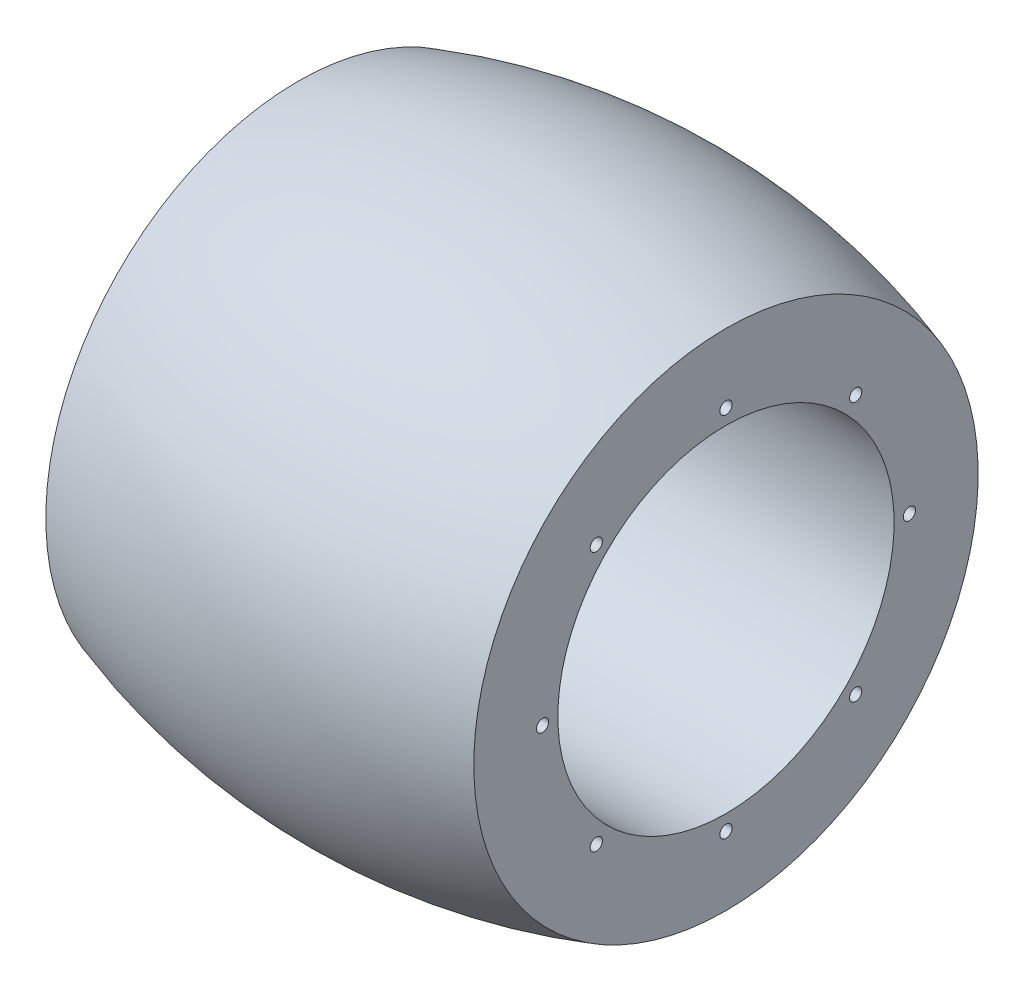
ISO-10303-21;
HEADER;
FILE_DESCRIPTION(('STEP AP214'),'2;1');
FILE_NAME('part.step','',(''),(''),'','','');
FILE_SCHEMA(('AUTOMOTIVE_DESIGN { 1 0 10303 214 1 1 1 1 }'));
ENDSEC;
DATA;
#1=APPLICATION_CONTEXT('core data for automotive mechanical design processes');
#2=APPLICATION_PROTOCOL_DEFINITION('international standard','automotive_design',2000,#1);
#3=PRODUCT_CONTEXT('',#1,'mechanical');
#4=PRODUCT('Part','Part','',(#3));
#5=PRODUCT_RELATED_PRODUCT_CATEGORY('part','',(#4));
#6=PRODUCT_DEFINITION_FORMATION('','',#4);
#7=PRODUCT_DEFINITION_CONTEXT('part definition',#1,'design');
#8=PRODUCT_DEFINITION('design','',#6,#7);
#9=PRODUCT_DEFINITION_SHAPE('','',#8);
#10=(LENGTH_UNIT() NAMED_UNIT(*) SI_UNIT(.MILLI.,.METRE.));
#11=(NAMED_UNIT(*) PLANE_ANGLE_UNIT() SI_UNIT($,.RADIAN.));
#12=(NAMED_UNIT(*) SI_UNIT($,.STERADIAN.) SOLID_ANGLE_UNIT());
#13=UNCERTAINTY_MEASURE_WITH_UNIT(LENGTH_MEASURE(1.E-05),#10,'distance_accuracy_value','');
#14=(GEOMETRIC_REPRESENTATION_CONTEXT(3) GLOBAL_UNCERTAINTY_ASSIGNED_CONTEXT((#13)) GLOBAL_UNIT_ASSIGNED_CONTEXT((#10,
#11,#12)) REPRESENTATION_CONTEXT('',''));
#15=CARTESIAN_POINT('',(0.,0.,0.));
#16=DIRECTION('',(0.,0.,1.));
#17=DIRECTION('',(1.,0.,0.));
#18=AXIS2_PLACEMENT_3D('',#15,#16,#17);
#19=CARTESIAN_POINT('',(-28.,0.,0.));
#20=DIRECTION('',(-1.,0.,0.));
#21=DIRECTION('',(0.,-1.,0.));
#22=AXIS2_PLACEMENT_3D('',#19,#20,#21);
#23=PLANE('',#22);
#24=CARTESIAN_POINT('',(-28.,0.,0.));
#25=DIRECTION('',(1.,0.,0.));
#26=DIRECTION('',(0.,1.,0.));
#27=AXIS2_PLACEMENT_3D('',#24,#25,#26);
#28=CIRCLE('',#27,22.);
#29=CARTESIAN_POINT('',(-28.,22.,0.));
#30=VERTEX_POINT('',#29);
#31=EDGE_CURVE('E11',#30,#30,#28,.T.);
#32=ORIENTED_EDGE('',*,*,#31,.T.);
#33=EDGE_LOOP('',(#32));
#34=FACE_BOUND('',#33,.T.);
#35=CARTESIAN_POINT('',(-28.,0.,0.));
#36=DIRECTION('',(1.,0.,0.));
#37=DIRECTION('',(0.,1.,0.));
#38=AXIS2_PLACEMENT_3D('',#35,#36,#37);
#39=CIRCLE('',#38,33.);
#40=CARTESIAN_POINT('',(-28.,33.,0.));
#41=VERTEX_POINT('',#40);
#42=EDGE_CURVE('E111',#41,#41,#39,.T.);
#43=ORIENTED_EDGE('',*,*,#42,.F.);
#44=EDGE_LOOP('',(#43));
#45=FACE_BOUND('',#44,.T.);
#46=ADVANCED_FACE('F37',(#34,#45),#23,.T.);
#47=CARTESIAN_POINT('',(0.,0.,0.));
#48=DIRECTION('',(1.,0.,0.));
#49=DIRECTION('',(0.,1.,0.));
#50=AXIS2_PLACEMENT_3D('',#47,#48,#49);
#51=CYLINDRICAL_SURFACE('',#50,22.);
#52=CARTESIAN_POINT('',(28.,0.,0.));
#53=DIRECTION('',(1.,0.,0.));
#54=DIRECTION('',(0.,1.,0.));
#55=AXIS2_PLACEMENT_3D('',#52,#53,#54);
#56=CIRCLE('',#55,22.);
#57=CARTESIAN_POINT('',(28.,22.,0.));
#58=VERTEX_POINT('',#57);
#59=EDGE_CURVE('E45',#58,#58,#56,.T.);
#60=ORIENTED_EDGE('',*,*,#59,.T.);
#61=EDGE_LOOP('',(#60));
#62=FACE_BOUND('',#61,.T.);
#63=ORIENTED_EDGE('',*,*,#31,.F.);
#64=EDGE_LOOP('',(#63));
#65=FACE_BOUND('',#64,.T.);
#66=ADVANCED_FACE('F154',(#62,#65),#51,.F.);
#67=CARTESIAN_POINT('',(28.,0.,0.));
#68=DIRECTION('',(-1.,0.,0.));
#69=DIRECTION('',(0.,-1.,0.));
#70=AXIS2_PLACEMENT_3D('',#67,#68,#69);
#71=PLANE('',#70);
#72=CARTESIAN_POINT('',(28.,24.,0.));
#73=DIRECTION('',(-1.,0.,0.));
#74=DIRECTION('',(0.,-1.,0.));
#75=AXIS2_PLACEMENT_3D('',#72,#73,#74);
#76=CIRCLE('',#75,0.799999999999999);
#77=CARTESIAN_POINT('',(28.,23.2,0.));
#78=VERTEX_POINT('',#77);
#79=EDGE_CURVE('E40',#78,#78,#76,.T.);
#80=ORIENTED_EDGE('',*,*,#79,.T.);
#81=EDGE_LOOP('',(#80));
#82=FACE_BOUND('',#81,.T.);
#83=CARTESIAN_POINT('',(28.,16.9705627484771,16.9705627484771));
#84=DIRECTION('',(-1.,0.,0.));
#85=DIRECTION('',(0.,-1.,0.));
#86=AXIS2_PLACEMENT_3D('',#83,#84,#85);
#87=CIRCLE('',#86,0.799999999999999);
#88=CARTESIAN_POINT('',(28.,16.1705627484771,16.9705627484771));
#89=VERTEX_POINT('',#88);
#90=EDGE_CURVE('E86',#89,#89,#87,.T.);
#91=ORIENTED_EDGE('',*,*,#90,.T.);
#92=EDGE_LOOP('',(#91));
#93=FACE_BOUND('',#92,.T.);
#94=CARTESIAN_POINT('',(28.,0.,24.));
#95=DIRECTION('',(-1.,0.,0.));
#96=DIRECTION('',(0.,-1.,0.));
#97=AXIS2_PLACEMENT_3D('',#94,#95,#96);
#98=CIRCLE('',#97,0.799999999999998);
#99=CARTESIAN_POINT('',(28.,-0.799999999999995,24.));
#100=VERTEX_POINT('',#99);
#101=EDGE_CURVE('E90',#100,#100,#98,.T.);
#102=ORIENTED_EDGE('',*,*,#101,.T.);
#103=EDGE_LOOP('',(#102));
#104=FACE_BOUND('',#103,.T.);
#105=CARTESIAN_POINT('',(28.,-16.9705627484771,16.9705627484771));
#106=DIRECTION('',(-1.,0.,0.));
#107=DIRECTION('',(0.,-1.,0.));
#108=AXIS2_PLACEMENT_3D('',#105,#106,#107);
#109=CIRCLE('',#108,0.799999999999999);
#110=CARTESIAN_POINT('',(28.,-17.7705627484771,16.9705627484771));
#111=VERTEX_POINT('',#110);
#112=EDGE_CURVE('E94',#111,#111,#109,.T.);
#113=ORIENTED_EDGE('',*,*,#112,.T.);
#114=EDGE_LOOP('',(#113));
#115=FACE_BOUND('',#114,.T.);
#116=CARTESIAN_POINT('',(28.,-24.,0.));
#117=DIRECTION('',(-1.,0.,0.));
#118=DIRECTION('',(0.,-1.,0.));
#119=AXIS2_PLACEMENT_3D('',#116,#117,#118);
#120=CIRCLE('',#119,0.799999999999999);
#121=CARTESIAN_POINT('',(28.,-24.8,0.));
#122=VERTEX_POINT('',#121);
#123=EDGE_CURVE('E98',#122,#122,#120,.T.);
#124=ORIENTED_EDGE('',*,*,#123,.T.);
#125=EDGE_LOOP('',(#124));
#126=FACE_BOUND('',#125,.T.);
#127=CARTESIAN_POINT('',(28.,-16.9705627484771,-16.9705627484771));
#128=DIRECTION('',(-1.,0.,0.));
#129=DIRECTION('',(0.,-1.,0.));
#130=AXIS2_PLACEMENT_3D('',#127,#128,#129);
#131=CIRCLE('',#130,0.799999999999999);
#132=CARTESIAN_POINT('',(28.,-17.7705627484771,-16.9705627484771));
#133=VERTEX_POINT('',#132);
#134=EDGE_CURVE('E102',#133,#133,#131,.T.);
#135=ORIENTED_EDGE('',*,*,#134,.T.);
#136=EDGE_LOOP('',(#135));
#137=FACE_BOUND('',#136,.T.);
#138=CARTESIAN_POINT('',(28.,0.,-24.));
#139=DIRECTION('',(-1.,0.,0.));
#140=DIRECTION('',(0.,-1.,0.));
#141=AXIS2_PLACEMENT_3D('',#138,#139,#140);
#142=CIRCLE('',#141,0.799999999999998);
#143=CARTESIAN_POINT('',(28.,-0.800000000000001,-24.));
#144=VERTEX_POINT('',#143);
#145=EDGE_CURVE('E106',#144,#144,#142,.T.);
#146=ORIENTED_EDGE('',*,*,#145,.T.);
#147=EDGE_LOOP('',(#146));
#148=FACE_BOUND('',#147,.T.);
#149=CARTESIAN_POINT('',(28.,16.9705627484771,-16.9705627484771));
#150=DIRECTION('',(-1.,0.,0.));
#151=DIRECTION('',(0.,-1.,0.));
#152=AXIS2_PLACEMENT_3D('',#149,#150,#151);
#153=CIRCLE('',#152,0.799999999999999);
#154=CARTESIAN_POINT('',(28.,16.1705627484771,-16.9705627484771));
#155=VERTEX_POINT('',#154);
#156=EDGE_CURVE('E110',#155,#155,#153,.T.);
#157=ORIENTED_EDGE('',*,*,#156,.T.);
#158=EDGE_LOOP('',(#157));
#159=FACE_BOUND('',#158,.T.);
#160=ORIENTED_EDGE('',*,*,#59,.F.);
#161=EDGE_LOOP('',(#160));
#162=FACE_BOUND('',#161,.T.);
#163=CARTESIAN_POINT('',(28.,0.,0.));
#164=DIRECTION('',(1.,0.,0.));
#165=DIRECTION('',(0.,1.,0.));
#166=AXIS2_PLACEMENT_3D('',#163,#164,#165);
#167=CIRCLE('',#166,33.);
#168=CARTESIAN_POINT('',(28.,33.,0.));
#169=VERTEX_POINT('',#168);
#170=EDGE_CURVE('E114',#169,#169,#167,.T.);
#171=ORIENTED_EDGE('',*,*,#170,.T.);
#172=EDGE_LOOP('',(#171));
#173=FACE_BOUND('',#172,.T.);
#174=ADVANCED_FACE('F134',(#82,#93,#104,#115,#126,#137,#148,#159,#162,#173),#71,.F.);
#175=CARTESIAN_POINT('',(0.,0.,0.));
#176=DIRECTION('',(1.,0.,0.));
#177=DIRECTION('',(0.,1.,0.));
#178=AXIS2_PLACEMENT_3D('',#175,#176,#177);
#179=DEGENERATE_TOROIDAL_SURFACE('',#178,51.8611111111111,89.3611111111111,.F.);
#180=ORIENTED_EDGE('',*,*,#170,.F.);
#181=EDGE_LOOP('',(#180));
#182=FACE_BOUND('',#181,.T.);
#183=ORIENTED_EDGE('',*,*,#42,.T.);
#184=EDGE_LOOP('',(#183));
#185=FACE_BOUND('',#184,.T.);
#186=ADVANCED_FACE('F164',(#182,#185),#179,.F.);
#187=CARTESIAN_POINT('',(32.5,16.9705627484771,-16.9705627484771));
#188=DIRECTION('',(1.,0.,0.));
#189=DIRECTION('',(0.,0.,-1.));
#190=AXIS2_PLACEMENT_3D('',#187,#188,#189);
#191=CYLINDRICAL_SURFACE('',#190,0.799999999999999);
#192=CARTESIAN_POINT('',(20.,16.9705627484771,-16.9705627484771));
#193=DIRECTION('',(1.,0.,0.));
#194=DIRECTION('',(0.,0.,-1.));
#195=AXIS2_PLACEMENT_3D('',#192,#193,#194);
#196=CIRCLE('',#195,0.799999999999999);
#197=CARTESIAN_POINT('',(20.,16.9705627484771,-17.7705627484771));
#198=VERTEX_POINT('',#197);
#199=EDGE_CURVE('E107',#198,#198,#196,.T.);
#200=ORIENTED_EDGE('',*,*,#199,.F.);
#201=EDGE_LOOP('',(#200));
#202=FACE_BOUND('',#201,.T.);
#203=ORIENTED_EDGE('',*,*,#156,.F.);
#204=EDGE_LOOP('',(#203));
#205=FACE_BOUND('',#204,.T.);
#206=ADVANCED_FACE('F166',(#202,#205),#191,.F.);
#207=CARTESIAN_POINT('',(20.,16.9705627484771,-16.9705627484771));
#208=DIRECTION('',(1.,0.,0.));
#209=DIRECTION('',(0.,0.,-1.));
#210=AXIS2_PLACEMENT_3D('',#207,#208,#209);
#211=CONICAL_SURFACE('',#210,0.799999999999999,1.02974425867665);
#212=CARTESIAN_POINT('',(19.519311504778,16.9705627484771,-16.9705627484771));
#213=VERTEX_POINT('',#212);
#214=VERTEX_LOOP('',#213);
#215=FACE_BOUND('',#214,.T.);
#216=ORIENTED_EDGE('',*,*,#199,.T.);
#217=EDGE_LOOP('',(#216));
#218=FACE_BOUND('',#217,.T.);
#219=ADVANCED_FACE('F173',(#215,#218),#211,.F.);
#220=CARTESIAN_POINT('',(32.5,0.,-24.));
#221=DIRECTION('',(1.,0.,0.));
#222=DIRECTION('',(0.,0.,-1.));
#223=AXIS2_PLACEMENT_3D('',#220,#221,#222);
#224=CYLINDRICAL_SURFACE('',#223,0.799999999999998);
#225=CARTESIAN_POINT('',(20.,0.,-24.));
#226=DIRECTION('',(1.,0.,0.));
#227=DIRECTION('',(0.,0.,-1.));
#228=AXIS2_PLACEMENT_3D('',#225,#226,#227);
#229=CIRCLE('',#228,0.799999999999997);
#230=CARTESIAN_POINT('',(20.,0.,-24.8));
#231=VERTEX_POINT('',#230);
#232=EDGE_CURVE('E103',#231,#231,#229,.T.);
#233=ORIENTED_EDGE('',*,*,#232,.F.);
#234=EDGE_LOOP('',(#233));
#235=FACE_BOUND('',#234,.T.);
#236=ORIENTED_EDGE('',*,*,#145,.F.);
#237=EDGE_LOOP('',(#236));
#238=FACE_BOUND('',#237,.T.);
#239=ADVANCED_FACE('F181',(#235,#238),#224,.F.);
#240=CARTESIAN_POINT('',(20.,0.,-24.));
#241=DIRECTION('',(1.,0.,0.));
#242=DIRECTION('',(0.,0.,-1.));
#243=AXIS2_PLACEMENT_3D('',#240,#241,#242);
#244=CONICAL_SURFACE('',#243,0.799999999999997,1.02974425867665);
#245=CARTESIAN_POINT('',(19.519311504778,0.,-24.));
#246=VERTEX_POINT('',#245);
#247=VERTEX_LOOP('',#246);
#248=FACE_BOUND('',#247,.T.);
#249=ORIENTED_EDGE('',*,*,#232,.T.);
#250=EDGE_LOOP('',(#249));
#251=FACE_BOUND('',#250,.T.);
#252=ADVANCED_FACE('F183',(#248,#251),#244,.F.);
#253=CARTESIAN_POINT('',(32.5,-16.9705627484771,-16.9705627484771));
#254=DIRECTION('',(1.,0.,0.));
#255=DIRECTION('',(0.,0.,-1.));
#256=AXIS2_PLACEMENT_3D('',#253,#254,#255);
#257=CYLINDRICAL_SURFACE('',#256,0.799999999999999);
#258=CARTESIAN_POINT('',(20.,-16.9705627484771,-16.9705627484771));
#259=DIRECTION('',(1.,0.,0.));
#260=DIRECTION('',(0.,0.,-1.));
#261=AXIS2_PLACEMENT_3D('',#258,#259,#260);
#262=CIRCLE('',#261,0.799999999999999);
#263=CARTESIAN_POINT('',(20.,-16.9705627484771,-17.7705627484771));
#264=VERTEX_POINT('',#263);
#265=EDGE_CURVE('E99',#264,#264,#262,.T.);
#266=ORIENTED_EDGE('',*,*,#265,.F.);
#267=EDGE_LOOP('',(#266));
#268=FACE_BOUND('',#267,.T.);
#269=ORIENTED_EDGE('',*,*,#134,.F.);
#270=EDGE_LOOP('',(#269));
#271=FACE_BOUND('',#270,.T.);
#272=ADVANCED_FACE('F186',(#268,#271),#257,.F.);
#273=CARTESIAN_POINT('',(20.,-16.9705627484771,-16.9705627484771));
#274=DIRECTION('',(1.,0.,0.));
#275=DIRECTION('',(0.,0.,-1.));
#276=AXIS2_PLACEMENT_3D('',#273,#274,#275);
#277=CONICAL_SURFACE('',#276,0.799999999999999,1.02974425867665);
#278=CARTESIAN_POINT('',(19.519311504778,-16.9705627484771,-16.9705627484771));
#279=VERTEX_POINT('',#278);
#280=VERTEX_LOOP('',#279);
#281=FACE_BOUND('',#280,.T.);
#282=ORIENTED_EDGE('',*,*,#265,.T.);
#283=EDGE_LOOP('',(#282));
#284=FACE_BOUND('',#283,.T.);
#285=ADVANCED_FACE('F190',(#281,#284),#277,.F.);
#286=CARTESIAN_POINT('',(32.5,-24.,0.));
#287=DIRECTION('',(1.,0.,0.));
#288=DIRECTION('',(0.,0.,-1.));
#289=AXIS2_PLACEMENT_3D('',#286,#287,#288);
#290=CYLINDRICAL_SURFACE('',#289,0.799999999999999);
#291=CARTESIAN_POINT('',(20.,-24.,0.));
#292=DIRECTION('',(1.,0.,0.));
#293=DIRECTION('',(0.,0.,-1.));
#294=AXIS2_PLACEMENT_3D('',#291,#292,#293);
#295=CIRCLE('',#294,0.799999999999999);
#296=CARTESIAN_POINT('',(20.,-24.,-0.799999999999997));
#297=VERTEX_POINT('',#296);
#298=EDGE_CURVE('E95',#297,#297,#295,.T.);
#299=ORIENTED_EDGE('',*,*,#298,.F.);
#300=EDGE_LOOP('',(#299));
#301=FACE_BOUND('',#300,.T.);
#302=ORIENTED_EDGE('',*,*,#123,.F.);
#303=EDGE_LOOP('',(#302));
#304=FACE_BOUND('',#303,.T.);
#305=ADVANCED_FACE('F193',(#301,#304),#290,.F.);
#306=CARTESIAN_POINT('',(20.,-24.,0.));
#307=DIRECTION('',(1.,0.,0.));
#308=DIRECTION('',(0.,0.,-1.));
#309=AXIS2_PLACEMENT_3D('',#306,#307,#308);
#310=CONICAL_SURFACE('',#309,0.799999999999999,1.02974425867665);
#311=CARTESIAN_POINT('',(19.5193115047779,-24.,0.));
#312=VERTEX_POINT('',#311);
#313=VERTEX_LOOP('',#312);
#314=FACE_BOUND('',#313,.T.);
#315=ORIENTED_EDGE('',*,*,#298,.T.);
#316=EDGE_LOOP('',(#315));
#317=FACE_BOUND('',#316,.T.);
#318=ADVANCED_FACE('F198',(#314,#317),#310,.F.);
#319=CARTESIAN_POINT('',(32.5,-16.9705627484771,16.9705627484771));
#320=DIRECTION('',(1.,0.,0.));
#321=DIRECTION('',(0.,0.,-1.));
#322=AXIS2_PLACEMENT_3D('',#319,#320,#321);
#323=CYLINDRICAL_SURFACE('',#322,0.799999999999999);
#324=CARTESIAN_POINT('',(20.,-16.9705627484771,16.9705627484771));
#325=DIRECTION('',(1.,0.,0.));
#326=DIRECTION('',(0.,0.,-1.));
#327=AXIS2_PLACEMENT_3D('',#324,#325,#326);
#328=CIRCLE('',#327,0.799999999999999);
#329=CARTESIAN_POINT('',(20.,-16.9705627484771,16.1705627484771));
#330=VERTEX_POINT('',#329);
#331=EDGE_CURVE('E91',#330,#330,#328,.T.);
#332=ORIENTED_EDGE('',*,*,#331,.F.);
#333=EDGE_LOOP('',(#332));
#334=FACE_BOUND('',#333,.T.);
#335=ORIENTED_EDGE('',*,*,#112,.F.);
#336=EDGE_LOOP('',(#335));
#337=FACE_BOUND('',#336,.T.);
#338=ADVANCED_FACE('F201',(#334,#337),#323,.F.);
#339=CARTESIAN_POINT('',(20.,-16.9705627484771,16.9705627484771));
#340=DIRECTION('',(1.,0.,0.));
#341=DIRECTION('',(0.,0.,-1.));
#342=AXIS2_PLACEMENT_3D('',#339,#340,#341);
#343=CONICAL_SURFACE('',#342,0.799999999999999,1.02974425867665);
#344=CARTESIAN_POINT('',(19.5193115047779,-16.9705627484771,16.9705627484771));
#345=VERTEX_POINT('',#344);
#346=VERTEX_LOOP('',#345);
#347=FACE_BOUND('',#346,.T.);
#348=ORIENTED_EDGE('',*,*,#331,.T.);
#349=EDGE_LOOP('',(#348));
#350=FACE_BOUND('',#349,.T.);
#351=ADVANCED_FACE('F206',(#347,#350),#343,.F.);
#352=CARTESIAN_POINT('',(32.5,0.,24.));
#353=DIRECTION('',(1.,0.,0.));
#354=DIRECTION('',(0.,0.,-1.));
#355=AXIS2_PLACEMENT_3D('',#352,#353,#354);
#356=CYLINDRICAL_SURFACE('',#355,0.799999999999998);
#357=CARTESIAN_POINT('',(20.,0.,24.));
#358=DIRECTION('',(1.,0.,0.));
#359=DIRECTION('',(0.,0.,-1.));
#360=AXIS2_PLACEMENT_3D('',#357,#358,#359);
#361=CIRCLE('',#360,0.799999999999997);
#362=CARTESIAN_POINT('',(20.,0.,23.2));
#363=VERTEX_POINT('',#362);
#364=EDGE_CURVE('E87',#363,#363,#361,.T.);
#365=ORIENTED_EDGE('',*,*,#364,.F.);
#366=EDGE_LOOP('',(#365));
#367=FACE_BOUND('',#366,.T.);
#368=ORIENTED_EDGE('',*,*,#101,.F.);
#369=EDGE_LOOP('',(#368));
#370=FACE_BOUND('',#369,.T.);
#371=ADVANCED_FACE('F149',(#367,#370),#356,.F.);
#372=CARTESIAN_POINT('',(20.,0.,24.));
#373=DIRECTION('',(1.,0.,0.));
#374=DIRECTION('',(0.,0.,-1.));
#375=AXIS2_PLACEMENT_3D('',#372,#373,#374);
#376=CONICAL_SURFACE('',#375,0.799999999999997,1.02974425867665);
#377=CARTESIAN_POINT('',(19.519311504778,0.,24.));
#378=VERTEX_POINT('',#377);
#379=VERTEX_LOOP('',#378);
#380=FACE_BOUND('',#379,.T.);
#381=ORIENTED_EDGE('',*,*,#364,.T.);
#382=EDGE_LOOP('',(#381));
#383=FACE_BOUND('',#382,.T.);
#384=ADVANCED_FACE('F140',(#380,#383),#376,.F.);
#385=CARTESIAN_POINT('',(32.5,16.9705627484771,16.9705627484771));
#386=DIRECTION('',(1.,0.,0.));
#387=DIRECTION('',(0.,0.,-1.));
#388=AXIS2_PLACEMENT_3D('',#385,#386,#387);
#389=CYLINDRICAL_SURFACE('',#388,0.799999999999999);
#390=CARTESIAN_POINT('',(20.,16.9705627484771,16.9705627484771));
#391=DIRECTION('',(1.,0.,0.));
#392=DIRECTION('',(0.,0.,-1.));
#393=AXIS2_PLACEMENT_3D('',#390,#391,#392);
#394=CIRCLE('',#393,0.799999999999999);
#395=CARTESIAN_POINT('',(20.,16.9705627484771,16.1705627484771));
#396=VERTEX_POINT('',#395);
#397=EDGE_CURVE('E82',#396,#396,#394,.T.);
#398=ORIENTED_EDGE('',*,*,#397,.F.);
#399=EDGE_LOOP('',(#398));
#400=FACE_BOUND('',#399,.T.);
#401=ORIENTED_EDGE('',*,*,#90,.F.);
#402=EDGE_LOOP('',(#401));
#403=FACE_BOUND('',#402,.T.);
#404=ADVANCED_FACE('F137',(#400,#403),#389,.F.);
#405=CARTESIAN_POINT('',(20.,16.9705627484771,16.9705627484771));
#406=DIRECTION('',(1.,0.,0.));
#407=DIRECTION('',(0.,0.,-1.));
#408=AXIS2_PLACEMENT_3D('',#405,#406,#407);
#409=CONICAL_SURFACE('',#408,0.799999999999999,1.02974425867665);
#410=CARTESIAN_POINT('',(19.519311504778,16.9705627484771,16.9705627484771));
#411=VERTEX_POINT('',#410);
#412=VERTEX_LOOP('',#411);
#413=FACE_BOUND('',#412,.T.);
#414=ORIENTED_EDGE('',*,*,#397,.T.);
#415=EDGE_LOOP('',(#414));
#416=FACE_BOUND('',#415,.T.);
#417=ADVANCED_FACE('F139',(#413,#416),#409,.F.);
#418=CARTESIAN_POINT('',(32.5,24.,0.));
#419=DIRECTION('',(1.,0.,0.));
#420=DIRECTION('',(0.,0.,-1.));
#421=AXIS2_PLACEMENT_3D('',#418,#419,#420);
#422=CYLINDRICAL_SURFACE('',#421,0.799999999999999);
#423=CARTESIAN_POINT('',(20.,24.,0.));
#424=DIRECTION('',(1.,0.,0.));
#425=DIRECTION('',(0.,0.,-1.));
#426=AXIS2_PLACEMENT_3D('',#423,#424,#425);
#427=CIRCLE('',#426,0.799999999999999);
#428=CARTESIAN_POINT('',(20.,24.,-0.8));
#429=VERTEX_POINT('',#428);
#430=EDGE_CURVE('E78',#429,#429,#427,.T.);
#431=ORIENTED_EDGE('',*,*,#430,.F.);
#432=EDGE_LOOP('',(#431));
#433=FACE_BOUND('',#432,.T.);
#434=ORIENTED_EDGE('',*,*,#79,.F.);
#435=EDGE_LOOP('',(#434));
#436=FACE_BOUND('',#435,.T.);
#437=ADVANCED_FACE('F74',(#433,#436),#422,.F.);
#438=CARTESIAN_POINT('',(20.,24.,0.));
#439=DIRECTION('',(1.,0.,0.));
#440=DIRECTION('',(0.,0.,-1.));
#441=AXIS2_PLACEMENT_3D('',#438,#439,#440);
#442=CONICAL_SURFACE('',#441,0.799999999999999,1.02974425867665);
#443=CARTESIAN_POINT('',(19.519311504778,24.,0.));
#444=VERTEX_POINT('',#443);
#445=VERTEX_LOOP('',#444);
#446=FACE_BOUND('',#445,.T.);
#447=ORIENTED_EDGE('',*,*,#430,.T.);
#448=EDGE_LOOP('',(#447));
#449=FACE_BOUND('',#448,.T.);
#450=ADVANCED_FACE('F71',(#446,#449),#442,.F.);
#451=CLOSED_SHELL('',(#46,#66,#174,#186,#206,#219,#239,#252,#272,#285,#305,#318,#338,#351,#371,
#384,#404,#417,#437,#450));
#452=MANIFOLD_SOLID_BREP('B2',#451);
#453=ADVANCED_BREP_SHAPE_REPRESENTATION('',(#18,#452),#14);
#454=SHAPE_DEFINITION_REPRESENTATION(#9,#453);
ENDSEC;
END-ISO-10303-21;
